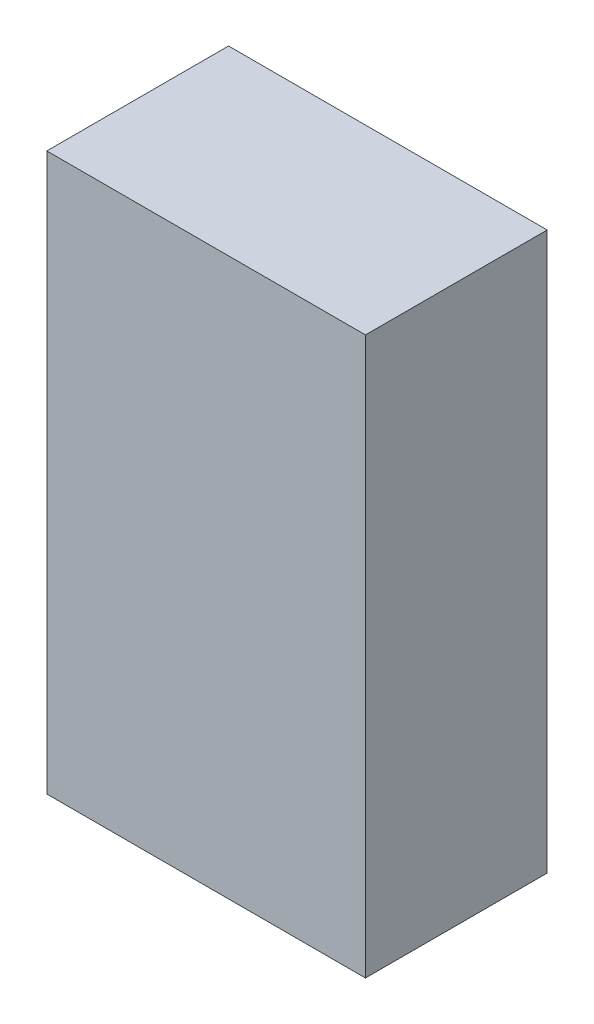
ISO-10303-21;
HEADER;
FILE_DESCRIPTION(('STEP AP214'),'2;1');
FILE_NAME('part.step','',(''),(''),'','','');
FILE_SCHEMA(('AUTOMOTIVE_DESIGN { 1 0 10303 214 1 1 1 1 }'));
ENDSEC;
DATA;
#1=APPLICATION_CONTEXT('core data for automotive mechanical design processes');
#2=APPLICATION_PROTOCOL_DEFINITION('international standard','automotive_design',2000,#1);
#3=PRODUCT_CONTEXT('',#1,'mechanical');
#4=PRODUCT('Part','Part','',(#3));
#5=PRODUCT_RELATED_PRODUCT_CATEGORY('part','',(#4));
#6=PRODUCT_DEFINITION_FORMATION('','',#4);
#7=PRODUCT_DEFINITION_CONTEXT('part definition',#1,'design');
#8=PRODUCT_DEFINITION('design','',#6,#7);
#9=PRODUCT_DEFINITION_SHAPE('','',#8);
#10=(LENGTH_UNIT() NAMED_UNIT(*) SI_UNIT(.MILLI.,.METRE.));
#11=(NAMED_UNIT(*) PLANE_ANGLE_UNIT() SI_UNIT($,.RADIAN.));
#12=(NAMED_UNIT(*) SI_UNIT($,.STERADIAN.) SOLID_ANGLE_UNIT());
#13=UNCERTAINTY_MEASURE_WITH_UNIT(LENGTH_MEASURE(1.E-05),#10,'distance_accuracy_value','');
#14=(GEOMETRIC_REPRESENTATION_CONTEXT(3) GLOBAL_UNCERTAINTY_ASSIGNED_CONTEXT((#13)) GLOBAL_UNIT_ASSIGNED_CONTEXT((#10,
#11,#12)) REPRESENTATION_CONTEXT('',''));
#15=CARTESIAN_POINT('',(0.,0.,0.));
#16=DIRECTION('',(0.,0.,1.));
#17=DIRECTION('',(1.,0.,0.));
#18=AXIS2_PLACEMENT_3D('',#15,#16,#17);
#19=CARTESIAN_POINT('',(-3.50671892,-6.1289946,3.99999962));
#20=DIRECTION('',(0.,0.,1.));
#21=DIRECTION('',(1.,0.,0.));
#22=AXIS2_PLACEMENT_3D('',#19,#20,#21);
#23=PLANE('',#22);
#24=DIRECTION('',(1.,0.,0.));
#25=VECTOR('',#24,1.);
#26=CARTESIAN_POINT('',(-3.50671892,6.1289946,3.99999962));
#27=LINE('',#26,#25);
#28=CARTESIAN_POINT('',(-3.50671892,6.1289946,3.99999962));
#29=VERTEX_POINT('',#28);
#30=CARTESIAN_POINT('',(3.50671892,6.1289946,3.99999962));
#31=VERTEX_POINT('',#30);
#32=EDGE_CURVE('E53',#29,#31,#27,.T.);
#33=ORIENTED_EDGE('',*,*,#32,.F.);
#34=DIRECTION('',(0.,1.,0.));
#35=VECTOR('',#34,1.);
#36=CARTESIAN_POINT('',(-3.50671892,-6.1289946,3.99999962));
#37=LINE('',#36,#35);
#38=CARTESIAN_POINT('',(-3.50671892,-6.1289946,3.99999962));
#39=VERTEX_POINT('',#38);
#40=EDGE_CURVE('E68',#39,#29,#37,.T.);
#41=ORIENTED_EDGE('',*,*,#40,.F.);
#42=DIRECTION('',(1.,0.,0.));
#43=VECTOR('',#42,1.);
#44=CARTESIAN_POINT('',(3.50671892,-6.1289946,3.99999962));
#45=LINE('',#44,#43);
#46=CARTESIAN_POINT('',(3.50671892,-6.1289946,3.99999962));
#47=VERTEX_POINT('',#46);
#48=EDGE_CURVE('E20',#47,#39,#45,.F.);
#49=ORIENTED_EDGE('',*,*,#48,.F.);
#50=DIRECTION('',(0.,1.,0.));
#51=VECTOR('',#50,1.);
#52=CARTESIAN_POINT('',(3.50671892,6.1289946,3.99999962));
#53=LINE('',#52,#51);
#54=EDGE_CURVE('E58',#31,#47,#53,.F.);
#55=ORIENTED_EDGE('',*,*,#54,.F.);
#56=EDGE_LOOP('',(#33,#41,#49,#55));
#57=FACE_BOUND('',#56,.T.);
#58=ADVANCED_FACE('F17',(#57),#23,.T.);
#59=CARTESIAN_POINT('',(3.50671892,-6.1289946,0.));
#60=DIRECTION('',(0.,-1.,0.));
#61=DIRECTION('',(0.,0.,-1.));
#62=AXIS2_PLACEMENT_3D('',#59,#60,#61);
#63=PLANE('',#62);
#64=DIRECTION('',(0.,0.,1.));
#65=VECTOR('',#64,1.);
#66=CARTESIAN_POINT('',(-3.50671892,-6.1289946,0.));
#67=LINE('',#66,#65);
#68=CARTESIAN_POINT('',(-3.50671892,-6.1289946,0.));
#69=VERTEX_POINT('',#68);
#70=EDGE_CURVE('E79',#69,#39,#67,.T.);
#71=ORIENTED_EDGE('',*,*,#70,.F.);
#72=DIRECTION('',(1.,0.,0.));
#73=VECTOR('',#72,1.);
#74=CARTESIAN_POINT('',(-3.50671892,-6.1289946,0.));
#75=LINE('',#74,#73);
#76=CARTESIAN_POINT('',(3.50671892,-6.1289946,0.));
#77=VERTEX_POINT('',#76);
#78=EDGE_CURVE('E74',#69,#77,#75,.T.);
#79=ORIENTED_EDGE('',*,*,#78,.T.);
#80=DIRECTION('',(0.,0.,-1.));
#81=VECTOR('',#80,1.);
#82=CARTESIAN_POINT('',(3.50671892,-6.1289946,0.));
#83=LINE('',#82,#81);
#84=EDGE_CURVE('E63',#47,#77,#83,.T.);
#85=ORIENTED_EDGE('',*,*,#84,.F.);
#86=ORIENTED_EDGE('',*,*,#48,.T.);
#87=EDGE_LOOP('',(#71,#79,#85,#86));
#88=FACE_BOUND('',#87,.T.);
#89=ADVANCED_FACE('F73',(#88),#63,.T.);
#90=CARTESIAN_POINT('',(3.50671892,6.1289946,0.));
#91=DIRECTION('',(1.,0.,0.));
#92=DIRECTION('',(0.,0.,-1.));
#93=AXIS2_PLACEMENT_3D('',#90,#91,#92);
#94=PLANE('',#93);
#95=ORIENTED_EDGE('',*,*,#84,.T.);
#96=DIRECTION('',(0.,1.,0.));
#97=VECTOR('',#96,1.);
#98=CARTESIAN_POINT('',(3.50671892,-6.1289946,0.));
#99=LINE('',#98,#97);
#100=CARTESIAN_POINT('',(3.50671892,6.1289946,0.));
#101=VERTEX_POINT('',#100);
#102=EDGE_CURVE('E84',#77,#101,#99,.T.);
#103=ORIENTED_EDGE('',*,*,#102,.T.);
#104=DIRECTION('',(0.,0.,1.));
#105=VECTOR('',#104,1.);
#106=CARTESIAN_POINT('',(3.50671892,6.1289946,0.));
#107=LINE('',#106,#105);
#108=EDGE_CURVE('E65',#31,#101,#107,.F.);
#109=ORIENTED_EDGE('',*,*,#108,.F.);
#110=ORIENTED_EDGE('',*,*,#54,.T.);
#111=EDGE_LOOP('',(#95,#103,#109,#110));
#112=FACE_BOUND('',#111,.T.);
#113=ADVANCED_FACE('F60',(#112),#94,.T.);
#114=CARTESIAN_POINT('',(-3.50671892,6.1289946,0.));
#115=DIRECTION('',(0.,1.,0.));
#116=DIRECTION('',(0.,0.,1.));
#117=AXIS2_PLACEMENT_3D('',#114,#115,#116);
#118=PLANE('',#117);
#119=ORIENTED_EDGE('',*,*,#108,.T.);
#120=DIRECTION('',(1.,0.,0.));
#121=VECTOR('',#120,1.);
#122=CARTESIAN_POINT('',(-3.50671892,6.1289946,0.));
#123=LINE('',#122,#121);
#124=CARTESIAN_POINT('',(-3.50671892,6.1289946,0.));
#125=VERTEX_POINT('',#124);
#126=EDGE_CURVE('E26',#101,#125,#123,.F.);
#127=ORIENTED_EDGE('',*,*,#126,.T.);
#128=DIRECTION('',(0.,0.,1.));
#129=VECTOR('',#128,1.);
#130=CARTESIAN_POINT('',(-3.50671892,6.1289946,0.));
#131=LINE('',#130,#129);
#132=EDGE_CURVE('E34',#29,#125,#131,.F.);
#133=ORIENTED_EDGE('',*,*,#132,.F.);
#134=ORIENTED_EDGE('',*,*,#32,.T.);
#135=EDGE_LOOP('',(#119,#127,#133,#134));
#136=FACE_BOUND('',#135,.T.);
#137=ADVANCED_FACE('F88',(#136),#118,.T.);
#138=CARTESIAN_POINT('',(-3.50671892,-6.1289946,0.));
#139=DIRECTION('',(-1.,0.,0.));
#140=DIRECTION('',(0.,0.,1.));
#141=AXIS2_PLACEMENT_3D('',#138,#139,#140);
#142=PLANE('',#141);
#143=ORIENTED_EDGE('',*,*,#132,.T.);
#144=DIRECTION('',(0.,1.,0.));
#145=VECTOR('',#144,1.);
#146=CARTESIAN_POINT('',(-3.50671892,-6.1289946,0.));
#147=LINE('',#146,#145);
#148=EDGE_CURVE('E11',#125,#69,#147,.F.);
#149=ORIENTED_EDGE('',*,*,#148,.T.);
#150=ORIENTED_EDGE('',*,*,#70,.T.);
#151=ORIENTED_EDGE('',*,*,#40,.T.);
#152=EDGE_LOOP('',(#143,#149,#150,#151));
#153=FACE_BOUND('',#152,.T.);
#154=ADVANCED_FACE('F91',(#153),#142,.T.);
#155=CARTESIAN_POINT('',(-3.50671892,-6.1289946,0.));
#156=DIRECTION('',(0.,0.,1.));
#157=DIRECTION('',(1.,0.,0.));
#158=AXIS2_PLACEMENT_3D('',#155,#156,#157);
#159=PLANE('',#158);
#160=ORIENTED_EDGE('',*,*,#126,.F.);
#161=ORIENTED_EDGE('',*,*,#102,.F.);
#162=ORIENTED_EDGE('',*,*,#78,.F.);
#163=ORIENTED_EDGE('',*,*,#148,.F.);
#164=EDGE_LOOP('',(#160,#161,#162,#163));
#165=FACE_BOUND('',#164,.T.);
#166=ADVANCED_FACE('F90',(#165),#159,.F.);
#167=CLOSED_SHELL('',(#58,#89,#113,#137,#154,#166));
#168=MANIFOLD_SOLID_BREP('B1',#167);
#169=ADVANCED_BREP_SHAPE_REPRESENTATION('',(#18,#168),#14);
#170=SHAPE_DEFINITION_REPRESENTATION(#9,#169);
ENDSEC;
END-ISO-10303-21;
